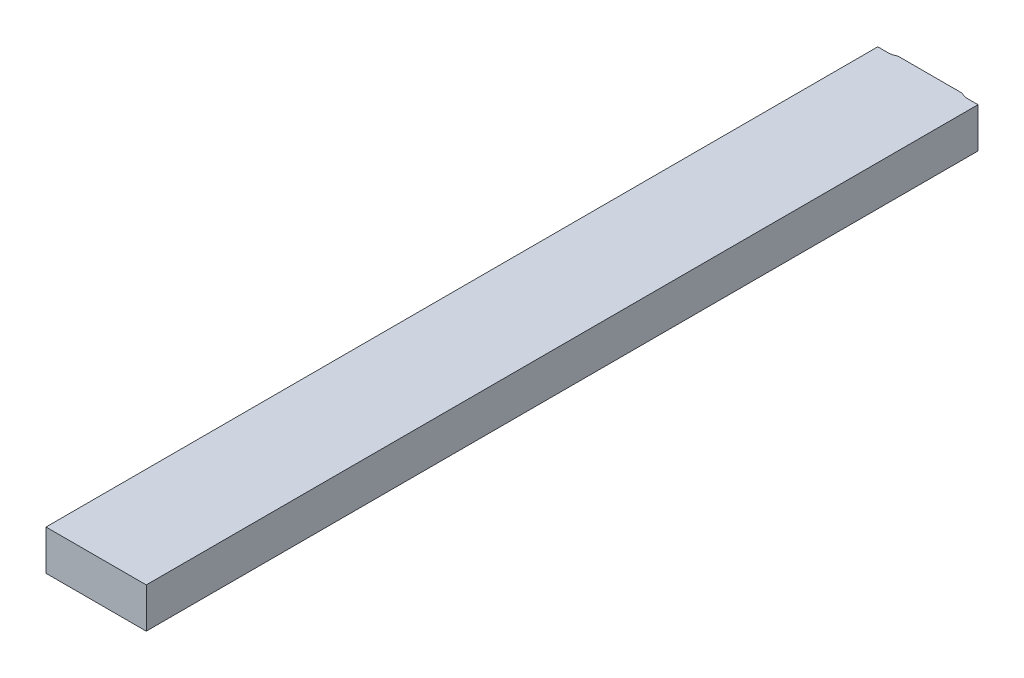
ISO-10303-21;
HEADER;
FILE_DESCRIPTION(('STEP AP214'),'2;1');
FILE_NAME('part.step','',(''),(''),'','','');
FILE_SCHEMA(('AUTOMOTIVE_DESIGN { 1 0 10303 214 1 1 1 1 }'));
ENDSEC;
DATA;
#1=APPLICATION_CONTEXT('core data for automotive mechanical design processes');
#2=APPLICATION_PROTOCOL_DEFINITION('international standard','automotive_design',2000,#1);
#3=PRODUCT_CONTEXT('',#1,'mechanical');
#4=PRODUCT('Part','Part','',(#3));
#5=PRODUCT_RELATED_PRODUCT_CATEGORY('part','',(#4));
#6=PRODUCT_DEFINITION_FORMATION('','',#4);
#7=PRODUCT_DEFINITION_CONTEXT('part definition',#1,'design');
#8=PRODUCT_DEFINITION('design','',#6,#7);
#9=PRODUCT_DEFINITION_SHAPE('','',#8);
#10=(LENGTH_UNIT() NAMED_UNIT(*) SI_UNIT(.MILLI.,.METRE.));
#11=(NAMED_UNIT(*) PLANE_ANGLE_UNIT() SI_UNIT($,.RADIAN.));
#12=(NAMED_UNIT(*) SI_UNIT($,.STERADIAN.) SOLID_ANGLE_UNIT());
#13=UNCERTAINTY_MEASURE_WITH_UNIT(LENGTH_MEASURE(1.E-05),#10,'distance_accuracy_value','');
#14=(GEOMETRIC_REPRESENTATION_CONTEXT(3) GLOBAL_UNCERTAINTY_ASSIGNED_CONTEXT((#13)) GLOBAL_UNIT_ASSIGNED_CONTEXT((#10,
#11,#12)) REPRESENTATION_CONTEXT('',''));
#15=CARTESIAN_POINT('',(0.,0.,0.));
#16=DIRECTION('',(0.,0.,1.));
#17=DIRECTION('',(1.,0.,0.));
#18=AXIS2_PLACEMENT_3D('',#15,#16,#17);
#19=CARTESIAN_POINT('',(2.5,0.275,-4.982138483572));
#20=DIRECTION('',(0.,1.,0.));
#21=DIRECTION('',(0.,0.,1.));
#22=AXIS2_PLACEMENT_3D('',#19,#20,#21);
#23=PLANE('',#22);
#24=DIRECTION('',(1.,0.,0.));
#25=VECTOR('',#24,1.);
#26=CARTESIAN_POINT('',(2.275,0.275,-7.051158663985));
#27=LINE('',#26,#25);
#28=CARTESIAN_POINT('',(2.25,0.275,-7.051158663985));
#29=VERTEX_POINT('',#28);
#30=CARTESIAN_POINT('',(2.30000000000174,0.275,-7.05115866398515));
#31=VERTEX_POINT('',#30);
#32=EDGE_CURVE('E184',#29,#31,#27,.T.);
#33=ORIENTED_EDGE('',*,*,#32,.T.);
#34=CARTESIAN_POINT('',(2.33925609382097,0.275,-7.06145062487903));
#35=CARTESIAN_POINT('',(2.33569437934613,0.275,-7.05943829430754));
#36=CARTESIAN_POINT('',(2.33197691458712,0.275,-7.05770911016996));
#37=CARTESIAN_POINT('',(2.324321331602,0.275,-7.05483826908997));
#38=CARTESIAN_POINT('',(2.32038321330713,0.275,-7.05369661233063));
#39=CARTESIAN_POINT('',(2.31100059388692,0.275,-7.05173413514556));
#40=CARTESIAN_POINT('',(2.3055037799839,0.275,-7.05115865434742));
#41=CARTESIAN_POINT('',(2.30000000000348,0.275,-7.0511586639853));
#42=B_SPLINE_CURVE_WITH_KNOTS('',3,(#34,#35,#36,#37,#38,#39,#40,#41),.UNSPECIFIED.,.F.,.F.,(4,2,
2,4),(0.,0.0122542009828683,0.0245084057837995,0.0409766482847967),.UNSPECIFIED.);
#43=CARTESIAN_POINT('',(2.33925609382097,0.275,-7.06145062487903));
#44=VERTEX_POINT('',#43);
#45=EDGE_CURVE('E93',#44,#31,#42,.T.);
#46=ORIENTED_EDGE('',*,*,#45,.F.);
#47=DIRECTION('',(1.,0.,0.));
#48=VECTOR('',#47,1.);
#49=CARTESIAN_POINT('',(2.500000048204,0.275,-7.061450624879));
#50=LINE('',#49,#48);
#51=CARTESIAN_POINT('',(2.660744002588,0.275,-7.06145062487899));
#52=VERTEX_POINT('',#51);
#53=EDGE_CURVE('E89',#44,#52,#50,.T.);
#54=ORIENTED_EDGE('',*,*,#53,.T.);
#55=CARTESIAN_POINT('',(2.69999999999649,0.275,-7.05115866398509));
#56=CARTESIAN_POINT('',(2.69591120722722,0.275,-7.05116284562048));
#57=CARTESIAN_POINT('',(2.69182388666645,0.275,-7.05148113218099));
#58=CARTESIAN_POINT('',(2.68374332584176,0.275,-7.05273057454798));
#59=CARTESIAN_POINT('',(2.67975010047702,0.275,-7.05366182674584));
#60=CARTESIAN_POINT('',(2.67060917233444,0.275,-7.05654480111922));
#61=CARTESIAN_POINT('',(2.66553664971063,0.275,-7.05873731135742));
#62=CARTESIAN_POINT('',(2.660744002588,0.275,-7.06145062487899));
#63=B_SPLINE_CURVE_WITH_KNOTS('',3,(#55,#56,#57,#58,#59,#60,#61,#62),.UNSPECIFIED.,.F.,.F.,(4,2,
2,4),(0.,0.0122527379750506,0.0245074032044938,0.0409759652394037),.UNSPECIFIED.);
#64=CARTESIAN_POINT('',(2.69999999999825,0.275,-7.05115866398506));
#65=VERTEX_POINT('',#64);
#66=EDGE_CURVE('E21',#65,#52,#63,.T.);
#67=ORIENTED_EDGE('',*,*,#66,.F.);
#68=DIRECTION('',(1.,0.,0.));
#69=VECTOR('',#68,1.);
#70=CARTESIAN_POINT('',(2.725,0.275,-7.051158663985));
#71=LINE('',#70,#69);
#72=CARTESIAN_POINT('',(2.75,0.275,-7.051158663985));
#73=VERTEX_POINT('',#72);
#74=EDGE_CURVE('E84',#65,#73,#71,.T.);
#75=ORIENTED_EDGE('',*,*,#74,.T.);
#76=DIRECTION('',(0.,0.,-1.));
#77=VECTOR('',#76,1.);
#78=CARTESIAN_POINT('',(2.75,0.275,-4.976992503125));
#79=LINE('',#78,#77);
#80=CARTESIAN_POINT('',(2.75,0.275,-2.902826342264));
#81=VERTEX_POINT('',#80);
#82=EDGE_CURVE('E218',#81,#73,#79,.T.);
#83=ORIENTED_EDGE('',*,*,#82,.F.);
#84=DIRECTION('',(1.,0.,0.));
#85=VECTOR('',#84,1.);
#86=CARTESIAN_POINT('',(2.5,0.275,-2.902826342264));
#87=LINE('',#86,#85);
#88=CARTESIAN_POINT('',(2.25,0.275,-2.902826342264));
#89=VERTEX_POINT('',#88);
#90=EDGE_CURVE('E204',#89,#81,#87,.T.);
#91=ORIENTED_EDGE('',*,*,#90,.F.);
#92=DIRECTION('',(0.,0.,-1.));
#93=VECTOR('',#92,1.);
#94=CARTESIAN_POINT('',(2.25,0.275,-4.976992503125));
#95=LINE('',#94,#93);
#96=EDGE_CURVE('E176',#89,#29,#95,.T.);
#97=ORIENTED_EDGE('',*,*,#96,.T.);
#98=EDGE_LOOP('',(#33,#46,#54,#67,#75,#83,#91,#97));
#99=FACE_BOUND('',#98,.T.);
#100=ADVANCED_FACE('F17',(#99),#23,.F.);
#101=CARTESIAN_POINT('',(2.75,0.375,-4.976992503125));
#102=DIRECTION('',(1.,0.,0.));
#103=DIRECTION('',(0.,0.,-1.));
#104=AXIS2_PLACEMENT_3D('',#101,#102,#103);
#105=PLANE('',#104);
#106=DIRECTION('',(0.,0.,1.));
#107=VECTOR('',#106,1.);
#108=CARTESIAN_POINT('',(2.75,0.475,-4.982138483572));
#109=LINE('',#108,#107);
#110=CARTESIAN_POINT('',(2.75,0.475,-2.902826342264));
#111=VERTEX_POINT('',#110);
#112=CARTESIAN_POINT('',(2.75,0.475,-7.051158663985));
#113=VERTEX_POINT('',#112);
#114=EDGE_CURVE('E189',#111,#113,#109,.F.);
#115=ORIENTED_EDGE('',*,*,#114,.F.);
#116=DIRECTION('',(0.,1.,0.));
#117=VECTOR('',#116,1.);
#118=CARTESIAN_POINT('',(2.75,0.375,-2.902826342264));
#119=LINE('',#118,#117);
#120=EDGE_CURVE('E203',#81,#111,#119,.T.);
#121=ORIENTED_EDGE('',*,*,#120,.F.);
#122=ORIENTED_EDGE('',*,*,#82,.T.);
#123=DIRECTION('',(0.,1.,0.));
#124=VECTOR('',#123,1.);
#125=CARTESIAN_POINT('',(2.75,0.375,-7.051158663985));
#126=LINE('',#125,#124);
#127=EDGE_CURVE('E233',#73,#113,#126,.T.);
#128=ORIENTED_EDGE('',*,*,#127,.T.);
#129=EDGE_LOOP('',(#115,#121,#122,#128));
#130=FACE_BOUND('',#129,.T.);
#131=ADVANCED_FACE('F238',(#130),#105,.T.);
#132=CARTESIAN_POINT('',(2.725,0.375,-7.051158663985));
#133=DIRECTION('',(0.,0.,1.));
#134=DIRECTION('',(1.,0.,0.));
#135=AXIS2_PLACEMENT_3D('',#132,#133,#134);
#136=PLANE('',#135);
#137=DIRECTION('',(1.,0.,0.));
#138=VECTOR('',#137,1.);
#139=CARTESIAN_POINT('',(2.5,0.475,-7.051158663985));
#140=LINE('',#139,#138);
#141=CARTESIAN_POINT('',(2.69999992664067,0.475,-7.05115866418437));
#142=VERTEX_POINT('',#141);
#143=EDGE_CURVE('E135',#113,#142,#140,.F.);
#144=ORIENTED_EDGE('',*,*,#143,.F.);
#145=ORIENTED_EDGE('',*,*,#127,.F.);
#146=ORIENTED_EDGE('',*,*,#74,.F.);
#147=DIRECTION('',(0.,1.,0.));
#148=VECTOR('',#147,1.);
#149=CARTESIAN_POINT('',(2.7,0.2699679840491,-7.05115866398508));
#150=LINE('',#149,#148);
#151=EDGE_CURVE('E103',#142,#65,#150,.F.);
#152=ORIENTED_EDGE('',*,*,#151,.F.);
#153=EDGE_LOOP('',(#144,#145,#146,#152));
#154=FACE_BOUND('',#153,.T.);
#155=ADVANCED_FACE('F125',(#154),#136,.F.);
#156=CARTESIAN_POINT('',(2.70251960942,0.2699679840491,-7.051190309039));
#157=CARTESIAN_POINT('',(2.70168041762,0.2699679840491,-7.051166943388));
#158=CARTESIAN_POINT('',(2.695615002363,0.2699679840491,-7.051090682037));
#159=CARTESIAN_POINT('',(2.684291413794,0.2699679840491,-7.052195104335));
#160=CARTESIAN_POINT('',(2.671141350335,0.2699679840491,-7.056177217872));
#161=CARTESIAN_POINT('',(2.662024122149,0.2699679840491,-7.060613467733));
#162=CARTESIAN_POINT('',(2.657842502067,0.2699679840491,-7.063145821386));
#163=CARTESIAN_POINT('',(2.656433777303,0.2699679840491,-7.064061090588));
#164=(BOUNDED_CURVE() B_SPLINE_CURVE(3,(#156,#157,#158,#159,#160,#161,#162,#163),.UNSPECIFIED.,
.F.,.F.) B_SPLINE_CURVE_WITH_KNOTS((4,1,1,1,1,4),(0.,0.05196482602246,0.3752098129395,
0.6983604955075,0.8962889073999,1.),
.UNSPECIFIED.) CURVE() GEOMETRIC_REPRESENTATION_ITEM() RATIONAL_B_SPLINE_CURVE((1.,1.,1.,1.,1.,
1.,1.,1.)) REPRESENTATION_ITEM(''));
#165=DIRECTION('',(0.,1.,0.));
#166=VECTOR('',#165,1.);
#167=SURFACE_OF_LINEAR_EXTRUSION('',#164,#166);
#168=ORIENTED_EDGE('',*,*,#66,.T.);
#169=DIRECTION('',(0.,1.,0.));
#170=VECTOR('',#169,1.);
#171=CARTESIAN_POINT('',(2.660744002588,0.375,-7.061450624879));
#172=LINE('',#171,#170);
#173=CARTESIAN_POINT('',(2.660744002588,0.475,-7.061450624879));
#174=VERTEX_POINT('',#173);
#175=EDGE_CURVE('E97',#52,#174,#172,.T.);
#176=ORIENTED_EDGE('',*,*,#175,.T.);
#177=CARTESIAN_POINT('',(2.69999985328134,0.475,-7.05115866438369));
#178=CARTESIAN_POINT('',(2.69591106051827,0.475,-7.0511628532203));
#179=CARTESIAN_POINT('',(2.69182374051208,0.475,-7.05148114713333));
#180=CARTESIAN_POINT('',(2.68374318193551,0.475,-7.05273060421157));
#181=CARTESIAN_POINT('',(2.6797499582645,0.475,-7.05366186376829));
#182=CARTESIAN_POINT('',(2.67060908193835,0.475,-7.05654484039364));
#183=CARTESIAN_POINT('',(2.66553660692722,0.475,-7.05873733584115));
#184=CARTESIAN_POINT('',(2.660744002588,0.475,-7.06145062487899));
#185=B_SPLINE_CURVE_WITH_KNOTS('',3,(#177,#178,#179,#180,#181,#182,#183,#184),.UNSPECIFIED.,.F.,
.F.,(4,2,2,4),(0.,0.0122527379884835,0.0245074032339877,0.0409758193004663),.UNSPECIFIED.);
#186=EDGE_CURVE('E129',#142,#174,#185,.T.);
#187=ORIENTED_EDGE('',*,*,#186,.F.);
#188=ORIENTED_EDGE('',*,*,#151,.T.);
#189=EDGE_LOOP('',(#168,#176,#187,#188));
#190=FACE_BOUND('',#189,.T.);
#191=ADVANCED_FACE('F100',(#190),#167,.T.);
#192=CARTESIAN_POINT('',(2.500000048204,0.375,-7.061450624879));
#193=DIRECTION('',(0.,0.,1.));
#194=DIRECTION('',(1.,0.,0.));
#195=AXIS2_PLACEMENT_3D('',#192,#193,#194);
#196=PLANE('',#195);
#197=ORIENTED_EDGE('',*,*,#53,.F.);
#198=DIRECTION('',(0.,1.,0.));
#199=VECTOR('',#198,1.);
#200=CARTESIAN_POINT('',(2.33925609382098,0.2699679840491,-7.06145062487904));
#201=LINE('',#200,#199);
#202=CARTESIAN_POINT('',(2.33925609382098,0.475,-7.06145062487903));
#203=VERTEX_POINT('',#202);
#204=EDGE_CURVE('E109',#203,#44,#201,.F.);
#205=ORIENTED_EDGE('',*,*,#204,.F.);
#206=DIRECTION('',(1.,0.,0.));
#207=VECTOR('',#206,1.);
#208=CARTESIAN_POINT('',(2.5,0.475,-7.061450624879));
#209=LINE('',#208,#207);
#210=EDGE_CURVE('E106',#174,#203,#209,.F.);
#211=ORIENTED_EDGE('',*,*,#210,.F.);
#212=ORIENTED_EDGE('',*,*,#175,.F.);
#213=EDGE_LOOP('',(#197,#205,#211,#212));
#214=FACE_BOUND('',#213,.T.);
#215=ADVANCED_FACE('F104',(#214),#196,.F.);
#216=CARTESIAN_POINT('',(2.343566307542,0.2699679840491,-7.064061118802));
#217=CARTESIAN_POINT('',(2.34215758621,0.2699679840491,-7.063145841608));
#218=CARTESIAN_POINT('',(2.337978107331,0.2699679840491,-7.060614746012));
#219=CARTESIAN_POINT('',(2.32886198488,0.2699679840491,-7.056178456814));
#220=CARTESIAN_POINT('',(2.315712040602,0.2699679840491,-7.052195755785));
#221=CARTESIAN_POINT('',(2.304386746271,0.2699679840491,-7.051090694486));
#222=CARTESIAN_POINT('',(2.298321131782,0.2699679840491,-7.051166937919));
#223=CARTESIAN_POINT('',(2.297482711636,0.2699679840491,-7.051190272618));
#224=(BOUNDED_CURVE() B_SPLINE_CURVE(3,(#216,#217,#218,#219,#220,#221,#222,#223),.UNSPECIFIED.,
.F.,.F.) B_SPLINE_CURVE_WITH_KNOTS((4,1,1,1,1,4),(0.,0.1037158878781,0.3014998794713,
0.6247605212749,0.9480806664175,1.),
.UNSPECIFIED.) CURVE() GEOMETRIC_REPRESENTATION_ITEM() RATIONAL_B_SPLINE_CURVE((1.,1.,1.,1.,1.,
1.,1.,1.)) REPRESENTATION_ITEM(''));
#225=DIRECTION('',(0.,1.,0.));
#226=VECTOR('',#225,1.);
#227=SURFACE_OF_LINEAR_EXTRUSION('',#224,#226);
#228=CARTESIAN_POINT('',(2.33925609382097,0.475,-7.06145062487904));
#229=CARTESIAN_POINT('',(2.33569437936902,0.475,-7.05943829433275));
#230=CARTESIAN_POINT('',(2.33197691459857,0.475,-7.05770911018256));
#231=CARTESIAN_POINT('',(2.32432133159056,0.475,-7.05483826907738));
#232=CARTESIAN_POINT('',(2.32038321328425,0.475,-7.05369661230544));
#233=CARTESIAN_POINT('',(2.31100064163172,0.475,-7.05173414515933));
#234=CARTESIAN_POINT('',(2.30550387761474,0.475,-7.05115866469184));
#235=CARTESIAN_POINT('',(2.30000014681143,0.475,-7.05115866438328));
#236=B_SPLINE_CURVE_WITH_KNOTS('',3,(#228,#229,#230,#231,#232,#233,#234,#235),.UNSPECIFIED.,.F.,
.F.,(4,2,2,4),(0.,0.0122542009828671,0.0245084057837987,0.0409765022206904),.UNSPECIFIED.);
#237=CARTESIAN_POINT('',(2.3,0.475,-7.051158663985));
#238=VERTEX_POINT('',#237);
#239=EDGE_CURVE('E136',#203,#238,#236,.T.);
#240=ORIENTED_EDGE('',*,*,#239,.F.);
#241=ORIENTED_EDGE('',*,*,#204,.T.);
#242=ORIENTED_EDGE('',*,*,#45,.T.);
#243=DIRECTION('',(0.,1.,0.));
#244=VECTOR('',#243,1.);
#245=CARTESIAN_POINT('',(2.3,0.375,-7.051158663985));
#246=LINE('',#245,#244);
#247=EDGE_CURVE('E182',#31,#238,#246,.T.);
#248=ORIENTED_EDGE('',*,*,#247,.T.);
#249=EDGE_LOOP('',(#240,#241,#242,#248));
#250=FACE_BOUND('',#249,.T.);
#251=ADVANCED_FACE('F159',(#250),#227,.T.);
#252=CARTESIAN_POINT('',(2.275,0.375,-7.051158663985));
#253=DIRECTION('',(0.,0.,1.));
#254=DIRECTION('',(1.,0.,0.));
#255=AXIS2_PLACEMENT_3D('',#252,#253,#254);
#256=PLANE('',#255);
#257=DIRECTION('',(1.,0.,0.));
#258=VECTOR('',#257,1.);
#259=CARTESIAN_POINT('',(2.5,0.475,-7.051158663985));
#260=LINE('',#259,#258);
#261=CARTESIAN_POINT('',(2.25,0.475,-7.051158663985));
#262=VERTEX_POINT('',#261);
#263=EDGE_CURVE('E181',#238,#262,#260,.F.);
#264=ORIENTED_EDGE('',*,*,#263,.F.);
#265=ORIENTED_EDGE('',*,*,#247,.F.);
#266=ORIENTED_EDGE('',*,*,#32,.F.);
#267=DIRECTION('',(0.,1.,0.));
#268=VECTOR('',#267,1.);
#269=CARTESIAN_POINT('',(2.25,0.375,-7.051158663985));
#270=LINE('',#269,#268);
#271=EDGE_CURVE('E174',#29,#262,#270,.T.);
#272=ORIENTED_EDGE('',*,*,#271,.T.);
#273=EDGE_LOOP('',(#264,#265,#266,#272));
#274=FACE_BOUND('',#273,.T.);
#275=ADVANCED_FACE('F157',(#274),#256,.F.);
#276=CARTESIAN_POINT('',(2.25,0.375,-4.976992503125));
#277=DIRECTION('',(1.,0.,0.));
#278=DIRECTION('',(0.,0.,-1.));
#279=AXIS2_PLACEMENT_3D('',#276,#277,#278);
#280=PLANE('',#279);
#281=ORIENTED_EDGE('',*,*,#271,.F.);
#282=ORIENTED_EDGE('',*,*,#96,.F.);
#283=DIRECTION('',(0.,1.,0.));
#284=VECTOR('',#283,1.);
#285=CARTESIAN_POINT('',(2.25,0.375,-2.902826342264));
#286=LINE('',#285,#284);
#287=CARTESIAN_POINT('',(2.25,0.475,-2.902826342264));
#288=VERTEX_POINT('',#287);
#289=EDGE_CURVE('E40',#288,#89,#286,.F.);
#290=ORIENTED_EDGE('',*,*,#289,.F.);
#291=DIRECTION('',(0.,0.,1.));
#292=VECTOR('',#291,1.);
#293=CARTESIAN_POINT('',(2.25,0.475,-4.982138483572));
#294=LINE('',#293,#292);
#295=EDGE_CURVE('E31',#262,#288,#294,.T.);
#296=ORIENTED_EDGE('',*,*,#295,.F.);
#297=EDGE_LOOP('',(#281,#282,#290,#296));
#298=FACE_BOUND('',#297,.T.);
#299=ADVANCED_FACE('F153',(#298),#280,.F.);
#300=CARTESIAN_POINT('',(2.5,0.375,-2.902826342264));
#301=DIRECTION('',(0.,0.,1.));
#302=DIRECTION('',(1.,0.,0.));
#303=AXIS2_PLACEMENT_3D('',#300,#301,#302);
#304=PLANE('',#303);
#305=ORIENTED_EDGE('',*,*,#120,.T.);
#306=DIRECTION('',(1.,0.,0.));
#307=VECTOR('',#306,1.);
#308=CARTESIAN_POINT('',(2.5,0.475,-2.902826342264));
#309=LINE('',#308,#307);
#310=EDGE_CURVE('E11',#288,#111,#309,.T.);
#311=ORIENTED_EDGE('',*,*,#310,.F.);
#312=ORIENTED_EDGE('',*,*,#289,.T.);
#313=ORIENTED_EDGE('',*,*,#90,.T.);
#314=EDGE_LOOP('',(#305,#311,#312,#313));
#315=FACE_BOUND('',#314,.T.);
#316=ADVANCED_FACE('F148',(#315),#304,.T.);
#317=CARTESIAN_POINT('',(2.5,0.475,-4.982138483572));
#318=DIRECTION('',(0.,1.,0.));
#319=DIRECTION('',(0.,0.,1.));
#320=AXIS2_PLACEMENT_3D('',#317,#318,#319);
#321=PLANE('',#320);
#322=ORIENTED_EDGE('',*,*,#295,.T.);
#323=ORIENTED_EDGE('',*,*,#310,.T.);
#324=ORIENTED_EDGE('',*,*,#114,.T.);
#325=ORIENTED_EDGE('',*,*,#143,.T.);
#326=ORIENTED_EDGE('',*,*,#186,.T.);
#327=ORIENTED_EDGE('',*,*,#210,.T.);
#328=ORIENTED_EDGE('',*,*,#239,.T.);
#329=ORIENTED_EDGE('',*,*,#263,.T.);
#330=EDGE_LOOP('',(#322,#323,#324,#325,#326,#327,#328,#329));
#331=FACE_BOUND('',#330,.T.);
#332=ADVANCED_FACE('F144',(#331),#321,.T.);
#333=CLOSED_SHELL('',(#100,#131,#155,#191,#215,#251,#275,#299,#316,#332));
#334=MANIFOLD_SOLID_BREP('B1',#333);
#335=ADVANCED_BREP_SHAPE_REPRESENTATION('',(#18,#334),#14);
#336=SHAPE_DEFINITION_REPRESENTATION(#9,#335);
ENDSEC;
END-ISO-10303-21;
